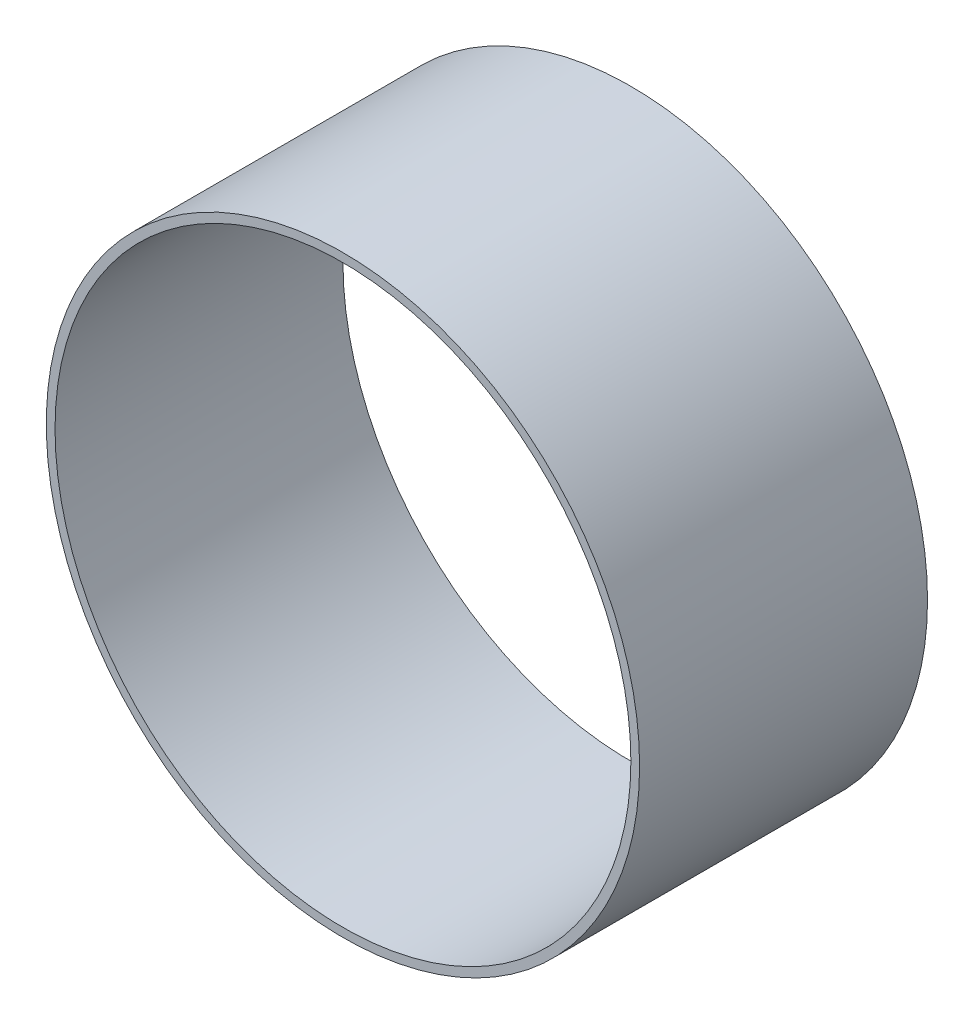
ISO-10303-21;
HEADER;
FILE_DESCRIPTION(('STEP AP214'),'2;1');
FILE_NAME('part.step','',(''),(''),'','','');
FILE_SCHEMA(('AUTOMOTIVE_DESIGN { 1 0 10303 214 1 1 1 1 }'));
ENDSEC;
DATA;
#1=APPLICATION_CONTEXT('core data for automotive mechanical design processes');
#2=APPLICATION_PROTOCOL_DEFINITION('international standard','automotive_design',2000,#1);
#3=PRODUCT_CONTEXT('',#1,'mechanical');
#4=PRODUCT('Part','Part','',(#3));
#5=PRODUCT_RELATED_PRODUCT_CATEGORY('part','',(#4));
#6=PRODUCT_DEFINITION_FORMATION('','',#4);
#7=PRODUCT_DEFINITION_CONTEXT('part definition',#1,'design');
#8=PRODUCT_DEFINITION('design','',#6,#7);
#9=PRODUCT_DEFINITION_SHAPE('','',#8);
#10=(LENGTH_UNIT() NAMED_UNIT(*) SI_UNIT(.MILLI.,.METRE.));
#11=(NAMED_UNIT(*) PLANE_ANGLE_UNIT() SI_UNIT($,.RADIAN.));
#12=(NAMED_UNIT(*) SI_UNIT($,.STERADIAN.) SOLID_ANGLE_UNIT());
#13=UNCERTAINTY_MEASURE_WITH_UNIT(LENGTH_MEASURE(1.E-05),#10,'distance_accuracy_value','');
#14=(GEOMETRIC_REPRESENTATION_CONTEXT(3) GLOBAL_UNCERTAINTY_ASSIGNED_CONTEXT((#13)) GLOBAL_UNIT_ASSIGNED_CONTEXT((#10,
#11,#12)) REPRESENTATION_CONTEXT('',''));
#15=CARTESIAN_POINT('',(0.,0.,0.));
#16=DIRECTION('',(0.,0.,1.));
#17=DIRECTION('',(1.,0.,0.));
#18=AXIS2_PLACEMENT_3D('',#15,#16,#17);
#19=CARTESIAN_POINT('',(0.,0.,19.05));
#20=DIRECTION('',(0.,0.,1.));
#21=DIRECTION('',(1.,0.,0.));
#22=AXIS2_PLACEMENT_3D('',#19,#20,#21);
#23=PLANE('',#22);
#24=CARTESIAN_POINT('',(0.,0.,19.05));
#25=DIRECTION('',(0.,0.,1.));
#26=DIRECTION('',(1.,0.,0.));
#27=AXIS2_PLACEMENT_3D('',#24,#25,#26);
#28=CIRCLE('',#27,39.2557);
#29=CARTESIAN_POINT('',(39.2557,0.,19.05));
#30=VERTEX_POINT('',#29);
#31=EDGE_CURVE('E10',#30,#30,#28,.T.);
#32=ORIENTED_EDGE('',*,*,#31,.T.);
#33=EDGE_LOOP('',(#32));
#34=FACE_BOUND('',#33,.T.);
#35=CARTESIAN_POINT('',(0.,0.,19.05));
#36=DIRECTION('',(0.,0.,1.));
#37=DIRECTION('',(1.,0.,0.));
#38=AXIS2_PLACEMENT_3D('',#35,#36,#37);
#39=CIRCLE('',#38,38.1);
#40=CARTESIAN_POINT('',(38.1,0.,19.05));
#41=VERTEX_POINT('',#40);
#42=EDGE_CURVE('E54',#41,#41,#39,.T.);
#43=ORIENTED_EDGE('',*,*,#42,.F.);
#44=EDGE_LOOP('',(#43));
#45=FACE_BOUND('',#44,.T.);
#46=ADVANCED_FACE('F43',(#34,#45),#23,.T.);
#47=CARTESIAN_POINT('',(0.,0.,-19.05));
#48=DIRECTION('',(0.,0.,1.));
#49=DIRECTION('',(1.,0.,0.));
#50=AXIS2_PLACEMENT_3D('',#47,#48,#49);
#51=PLANE('',#50);
#52=CARTESIAN_POINT('',(0.,0.,-19.05));
#53=DIRECTION('',(0.,0.,1.));
#54=DIRECTION('',(1.,0.,0.));
#55=AXIS2_PLACEMENT_3D('',#52,#53,#54);
#56=CIRCLE('',#55,39.2557);
#57=CARTESIAN_POINT('',(39.2557,0.,-19.05));
#58=VERTEX_POINT('',#57);
#59=EDGE_CURVE('E47',#58,#58,#56,.T.);
#60=ORIENTED_EDGE('',*,*,#59,.F.);
#61=EDGE_LOOP('',(#60));
#62=FACE_BOUND('',#61,.T.);
#63=CARTESIAN_POINT('',(0.,0.,-19.05));
#64=DIRECTION('',(0.,0.,1.));
#65=DIRECTION('',(1.,0.,0.));
#66=AXIS2_PLACEMENT_3D('',#63,#64,#65);
#67=CIRCLE('',#66,38.1);
#68=CARTESIAN_POINT('',(38.1,0.,-19.05));
#69=VERTEX_POINT('',#68);
#70=EDGE_CURVE('E56',#69,#69,#67,.T.);
#71=ORIENTED_EDGE('',*,*,#70,.T.);
#72=EDGE_LOOP('',(#71));
#73=FACE_BOUND('',#72,.T.);
#74=ADVANCED_FACE('F66',(#62,#73),#51,.F.);
#75=CARTESIAN_POINT('',(0.,0.,19.05));
#76=DIRECTION('',(0.,0.,-1.));
#77=DIRECTION('',(-1.,0.,0.));
#78=AXIS2_PLACEMENT_3D('',#75,#76,#77);
#79=CYLINDRICAL_SURFACE('',#78,39.2557);
#80=ORIENTED_EDGE('',*,*,#31,.F.);
#81=EDGE_LOOP('',(#80));
#82=FACE_BOUND('',#81,.T.);
#83=ORIENTED_EDGE('',*,*,#59,.T.);
#84=EDGE_LOOP('',(#83));
#85=FACE_BOUND('',#84,.T.);
#86=ADVANCED_FACE('F45',(#82,#85),#79,.T.);
#87=CARTESIAN_POINT('',(0.,0.,19.05));
#88=DIRECTION('',(0.,0.,-1.));
#89=DIRECTION('',(-1.,0.,0.));
#90=AXIS2_PLACEMENT_3D('',#87,#88,#89);
#91=CYLINDRICAL_SURFACE('',#90,38.1);
#92=ORIENTED_EDGE('',*,*,#42,.T.);
#93=EDGE_LOOP('',(#92));
#94=FACE_BOUND('',#93,.T.);
#95=ORIENTED_EDGE('',*,*,#70,.F.);
#96=EDGE_LOOP('',(#95));
#97=FACE_BOUND('',#96,.T.);
#98=ADVANCED_FACE('F62',(#94,#97),#91,.F.);
#99=CLOSED_SHELL('',(#46,#74,#86,#98));
#100=MANIFOLD_SOLID_BREP('B2',#99);
#101=ADVANCED_BREP_SHAPE_REPRESENTATION('',(#18,#100),#14);
#102=SHAPE_DEFINITION_REPRESENTATION(#9,#101);
ENDSEC;
END-ISO-10303-21;
